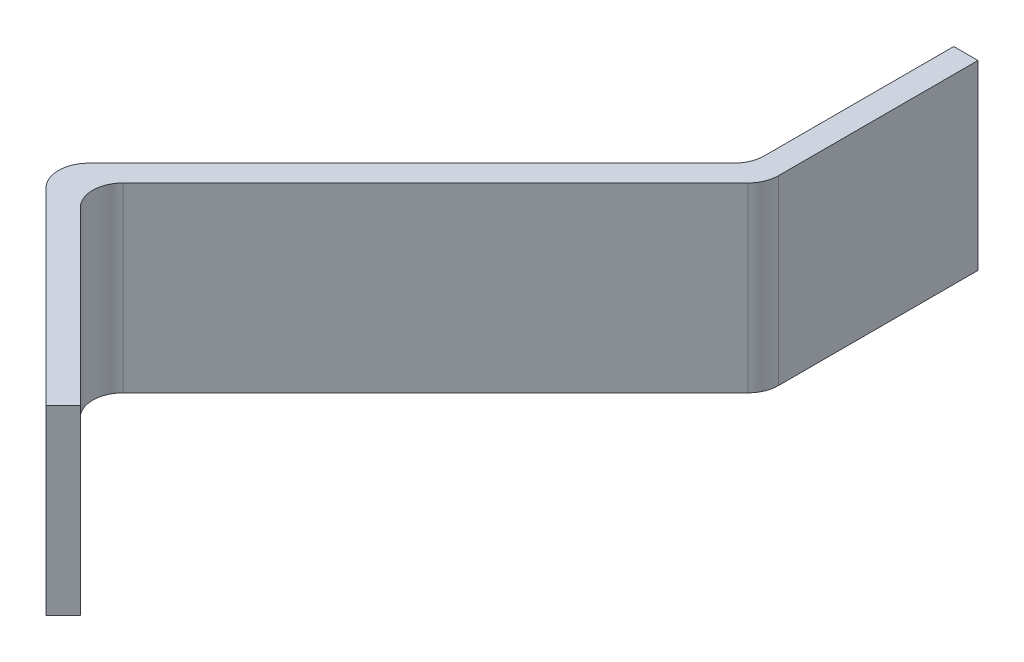
ISO-10303-21;
HEADER;
FILE_DESCRIPTION(('STEP AP214'),'2;1');
FILE_NAME('part.step','',(''),(''),'','','');
FILE_SCHEMA(('AUTOMOTIVE_DESIGN { 1 0 10303 214 1 1 1 1 }'));
ENDSEC;
DATA;
#1=APPLICATION_CONTEXT('core data for automotive mechanical design processes');
#2=APPLICATION_PROTOCOL_DEFINITION('international standard','automotive_design',2000,#1);
#3=PRODUCT_CONTEXT('',#1,'mechanical');
#4=PRODUCT('Part','Part','',(#3));
#5=PRODUCT_RELATED_PRODUCT_CATEGORY('part','',(#4));
#6=PRODUCT_DEFINITION_FORMATION('','',#4);
#7=PRODUCT_DEFINITION_CONTEXT('part definition',#1,'design');
#8=PRODUCT_DEFINITION('design','',#6,#7);
#9=PRODUCT_DEFINITION_SHAPE('','',#8);
#10=(LENGTH_UNIT() NAMED_UNIT(*) SI_UNIT(.MILLI.,.METRE.));
#11=(NAMED_UNIT(*) PLANE_ANGLE_UNIT() SI_UNIT($,.RADIAN.));
#12=(NAMED_UNIT(*) SI_UNIT($,.STERADIAN.) SOLID_ANGLE_UNIT());
#13=UNCERTAINTY_MEASURE_WITH_UNIT(LENGTH_MEASURE(1.E-05),#10,'distance_accuracy_value','');
#14=(GEOMETRIC_REPRESENTATION_CONTEXT(3) GLOBAL_UNCERTAINTY_ASSIGNED_CONTEXT((#13)) GLOBAL_UNIT_ASSIGNED_CONTEXT((#10,
#11,#12)) REPRESENTATION_CONTEXT('',''));
#15=CARTESIAN_POINT('',(0.,0.,0.));
#16=DIRECTION('',(0.,0.,1.));
#17=DIRECTION('',(1.,0.,0.));
#18=AXIS2_PLACEMENT_3D('',#15,#16,#17);
#19=CARTESIAN_POINT('',(-245.256587827417,-22.5,-1.7746032555829));
#20=DIRECTION('',(0.,1.,0.));
#21=DIRECTION('',(0.,0.,1.));
#22=AXIS2_PLACEMENT_3D('',#19,#20,#21);
#23=CYLINDRICAL_SURFACE('',#22,5.);
#24=CARTESIAN_POINT('',(-245.256587827417,7.5,-1.7746032555829));
#25=DIRECTION('',(0.,1.,0.));
#26=DIRECTION('',(0.,0.,1.));
#27=AXIS2_PLACEMENT_3D('',#24,#25,#26);
#28=CIRCLE('',#27,5.);
#29=CARTESIAN_POINT('',(-248.79212173335,7.5,-5.31013716151563));
#30=VERTEX_POINT('',#29);
#31=CARTESIAN_POINT('',(-248.79212173335,7.5,1.76093065034988));
#32=VERTEX_POINT('',#31);
#33=EDGE_CURVE('E154',#30,#32,#28,.T.);
#34=ORIENTED_EDGE('',*,*,#33,.F.);
#35=DIRECTION('',(0.,1.,0.));
#36=VECTOR('',#35,1.);
#37=CARTESIAN_POINT('',(-248.79212173335,-22.5,-5.31013716151563));
#38=LINE('',#37,#36);
#39=CARTESIAN_POINT('',(-248.79212173335,-22.5,-5.31013716151563));
#40=VERTEX_POINT('',#39);
#41=EDGE_CURVE('E11',#40,#30,#38,.T.);
#42=ORIENTED_EDGE('',*,*,#41,.F.);
#43=CARTESIAN_POINT('',(-245.256587827417,-22.5,-1.7746032555829));
#44=DIRECTION('',(0.,1.,0.));
#45=DIRECTION('',(0.,0.,1.));
#46=AXIS2_PLACEMENT_3D('',#43,#44,#45);
#47=CIRCLE('',#46,5.);
#48=CARTESIAN_POINT('',(-248.79212173335,-22.5,1.76093065034988));
#49=VERTEX_POINT('',#48);
#50=EDGE_CURVE('E186',#40,#49,#47,.T.);
#51=ORIENTED_EDGE('',*,*,#50,.T.);
#52=DIRECTION('',(0.,1.,0.));
#53=VECTOR('',#52,1.);
#54=CARTESIAN_POINT('',(-248.79212173335,-22.5,1.76093065034988));
#55=LINE('',#54,#53);
#56=EDGE_CURVE('E36',#49,#32,#55,.T.);
#57=ORIENTED_EDGE('',*,*,#56,.T.);
#58=EDGE_LOOP('',(#34,#42,#51,#57));
#59=FACE_BOUND('',#58,.T.);
#60=ADVANCED_FACE('F33',(#59),#23,.T.);
#61=CARTESIAN_POINT('',(-195.566724988935,-22.5,-58.5355339059331));
#62=DIRECTION('',(-0.707106781186565,0.,-0.70710678118653));
#63=DIRECTION('',(-0.70710678118653,0.,0.707106781186565));
#64=AXIS2_PLACEMENT_3D('',#61,#62,#63);
#65=PLANE('',#64);
#66=DIRECTION('',(-0.70710678118653,0.,0.707106781186565));
#67=VECTOR('',#66,1.);
#68=CARTESIAN_POINT('',(-195.566724988935,7.5,-58.5355339059331));
#69=LINE('',#68,#67);
#70=CARTESIAN_POINT('',(-195.566724988935,7.5,-58.5355339059331));
#71=VERTEX_POINT('',#70);
#72=EDGE_CURVE('E184',#71,#30,#69,.T.);
#73=ORIENTED_EDGE('',*,*,#72,.F.);
#74=DIRECTION('',(0.,1.,0.));
#75=VECTOR('',#74,1.);
#76=CARTESIAN_POINT('',(-195.566724988935,-22.5,-58.5355339059331));
#77=LINE('',#76,#75);
#78=CARTESIAN_POINT('',(-195.566724988935,-22.5,-58.5355339059331));
#79=VERTEX_POINT('',#78);
#80=EDGE_CURVE('E42',#79,#71,#77,.T.);
#81=ORIENTED_EDGE('',*,*,#80,.F.);
#82=DIRECTION('',(-0.70710678118653,0.,0.707106781186565));
#83=VECTOR('',#82,1.);
#84=CARTESIAN_POINT('',(-195.566724988935,-22.5,-58.5355339059331));
#85=LINE('',#84,#83);
#86=EDGE_CURVE('E144',#79,#40,#85,.T.);
#87=ORIENTED_EDGE('',*,*,#86,.T.);
#88=ORIENTED_EDGE('',*,*,#41,.T.);
#89=EDGE_LOOP('',(#73,#81,#87,#88));
#90=FACE_BOUND('',#89,.T.);
#91=ADVANCED_FACE('F206',(#90),#65,.T.);
#92=CARTESIAN_POINT('',(-199.102258894868,-22.5,-62.0710678118658));
#93=DIRECTION('',(0.,1.,0.));
#94=DIRECTION('',(0.,0.,1.));
#95=AXIS2_PLACEMENT_3D('',#92,#93,#94);
#96=CYLINDRICAL_SURFACE('',#95,4.99999999999999);
#97=CARTESIAN_POINT('',(-199.102258894868,7.5,-62.0710678118658));
#98=DIRECTION('',(0.,-1.,0.));
#99=DIRECTION('',(0.,0.,1.));
#100=AXIS2_PLACEMENT_3D('',#97,#98,#99);
#101=CIRCLE('',#100,4.99999999999999);
#102=CARTESIAN_POINT('',(-194.102258894868,7.5,-62.0710678118658));
#103=VERTEX_POINT('',#102);
#104=EDGE_CURVE('E131',#103,#71,#101,.T.);
#105=ORIENTED_EDGE('',*,*,#104,.F.);
#106=DIRECTION('',(0.,1.,0.));
#107=VECTOR('',#106,1.);
#108=CARTESIAN_POINT('',(-194.102258894868,-22.5,-62.0710678118658));
#109=LINE('',#108,#107);
#110=CARTESIAN_POINT('',(-194.102258894868,-22.5,-62.0710678118658));
#111=VERTEX_POINT('',#110);
#112=EDGE_CURVE('E126',#111,#103,#109,.T.);
#113=ORIENTED_EDGE('',*,*,#112,.F.);
#114=CARTESIAN_POINT('',(-199.102258894868,-22.5,-62.0710678118658));
#115=DIRECTION('',(0.,-1.,0.));
#116=DIRECTION('',(0.,0.,1.));
#117=AXIS2_PLACEMENT_3D('',#114,#115,#116);
#118=CIRCLE('',#117,4.99999999999999);
#119=EDGE_CURVE('E129',#111,#79,#118,.T.);
#120=ORIENTED_EDGE('',*,*,#119,.T.);
#121=ORIENTED_EDGE('',*,*,#80,.T.);
#122=EDGE_LOOP('',(#105,#113,#120,#121));
#123=FACE_BOUND('',#122,.T.);
#124=ADVANCED_FACE('F128',(#123),#96,.F.);
#125=CARTESIAN_POINT('',(-194.102258894868,-22.5,-93.343145750508));
#126=DIRECTION('',(-1.,0.,0.));
#127=DIRECTION('',(0.,0.,1.));
#128=AXIS2_PLACEMENT_3D('',#125,#126,#127);
#129=PLANE('',#128);
#130=DIRECTION('',(0.,0.,1.));
#131=VECTOR('',#130,1.);
#132=CARTESIAN_POINT('',(-194.102258894868,7.5,-93.343145750508));
#133=LINE('',#132,#131);
#134=CARTESIAN_POINT('',(-194.102258894868,7.5,-93.343145750508));
#135=VERTEX_POINT('',#134);
#136=EDGE_CURVE('E181',#135,#103,#133,.T.);
#137=ORIENTED_EDGE('',*,*,#136,.F.);
#138=DIRECTION('',(0.,1.,0.));
#139=VECTOR('',#138,1.);
#140=CARTESIAN_POINT('',(-194.102258894868,-22.5,-93.343145750508));
#141=LINE('',#140,#139);
#142=CARTESIAN_POINT('',(-194.102258894868,-22.5,-93.343145750508));
#143=VERTEX_POINT('',#142);
#144=EDGE_CURVE('E136',#143,#135,#141,.T.);
#145=ORIENTED_EDGE('',*,*,#144,.F.);
#146=DIRECTION('',(0.,0.,1.));
#147=VECTOR('',#146,1.);
#148=CARTESIAN_POINT('',(-194.102258894868,-22.5,-93.343145750508));
#149=LINE('',#148,#147);
#150=EDGE_CURVE('E142',#143,#111,#149,.T.);
#151=ORIENTED_EDGE('',*,*,#150,.T.);
#152=ORIENTED_EDGE('',*,*,#112,.T.);
#153=EDGE_LOOP('',(#137,#145,#151,#152));
#154=FACE_BOUND('',#153,.T.);
#155=ADVANCED_FACE('F146',(#154),#129,.T.);
#156=CARTESIAN_POINT('',(-190.102258894868,-22.5,-93.343145750508));
#157=DIRECTION('',(0.,0.,-1.));
#158=DIRECTION('',(-1.,0.,0.));
#159=AXIS2_PLACEMENT_3D('',#156,#157,#158);
#160=PLANE('',#159);
#161=DIRECTION('',(-1.,0.,0.));
#162=VECTOR('',#161,1.);
#163=CARTESIAN_POINT('',(-190.102258894868,7.5,-93.343145750508));
#164=LINE('',#163,#162);
#165=CARTESIAN_POINT('',(-190.102258894868,7.5,-93.343145750508));
#166=VERTEX_POINT('',#165);
#167=EDGE_CURVE('E178',#166,#135,#164,.T.);
#168=ORIENTED_EDGE('',*,*,#167,.F.);
#169=DIRECTION('',(0.,1.,0.));
#170=VECTOR('',#169,1.);
#171=CARTESIAN_POINT('',(-190.102258894868,-22.5,-93.343145750508));
#172=LINE('',#171,#170);
#173=CARTESIAN_POINT('',(-190.102258894868,-22.5,-93.343145750508));
#174=VERTEX_POINT('',#173);
#175=EDGE_CURVE('E190',#174,#166,#172,.T.);
#176=ORIENTED_EDGE('',*,*,#175,.F.);
#177=DIRECTION('',(-1.,0.,0.));
#178=VECTOR('',#177,1.);
#179=CARTESIAN_POINT('',(-190.102258894868,-22.5,-93.343145750508));
#180=LINE('',#179,#178);
#181=EDGE_CURVE('E147',#174,#143,#180,.T.);
#182=ORIENTED_EDGE('',*,*,#181,.T.);
#183=ORIENTED_EDGE('',*,*,#144,.T.);
#184=EDGE_LOOP('',(#168,#176,#182,#183));
#185=FACE_BOUND('',#184,.T.);
#186=ADVANCED_FACE('F219',(#185),#160,.T.);
#187=CARTESIAN_POINT('',(-190.102258894868,-22.5,-60.4142135623735));
#188=DIRECTION('',(1.,0.,0.));
#189=DIRECTION('',(0.,0.,-1.));
#190=AXIS2_PLACEMENT_3D('',#187,#188,#189);
#191=PLANE('',#190);
#192=DIRECTION('',(0.,0.,-1.));
#193=VECTOR('',#192,1.);
#194=CARTESIAN_POINT('',(-190.102258894868,7.5,-60.4142135623735));
#195=LINE('',#194,#193);
#196=CARTESIAN_POINT('',(-190.102258894868,7.5,-60.4142135623735));
#197=VERTEX_POINT('',#196);
#198=EDGE_CURVE('E175',#197,#166,#195,.T.);
#199=ORIENTED_EDGE('',*,*,#198,.F.);
#200=DIRECTION('',(0.,1.,0.));
#201=VECTOR('',#200,1.);
#202=CARTESIAN_POINT('',(-190.102258894868,-22.5,-60.4142135623735));
#203=LINE('',#202,#201);
#204=CARTESIAN_POINT('',(-190.102258894868,-22.5,-60.4142135623735));
#205=VERTEX_POINT('',#204);
#206=EDGE_CURVE('E192',#205,#197,#203,.T.);
#207=ORIENTED_EDGE('',*,*,#206,.F.);
#208=DIRECTION('',(0.,0.,-1.));
#209=VECTOR('',#208,1.);
#210=CARTESIAN_POINT('',(-190.102258894868,-22.5,-60.4142135623735));
#211=LINE('',#210,#209);
#212=EDGE_CURVE('E149',#205,#174,#211,.T.);
#213=ORIENTED_EDGE('',*,*,#212,.T.);
#214=ORIENTED_EDGE('',*,*,#175,.T.);
#215=EDGE_LOOP('',(#199,#207,#213,#214));
#216=FACE_BOUND('',#215,.T.);
#217=ADVANCED_FACE('F222',(#216),#191,.T.);
#218=CARTESIAN_POINT('',(-195.102258894868,-22.5,-60.4142135623735));
#219=DIRECTION('',(0.,1.,0.));
#220=DIRECTION('',(0.,0.,1.));
#221=AXIS2_PLACEMENT_3D('',#218,#219,#220);
#222=CYLINDRICAL_SURFACE('',#221,5.00000000000002);
#223=CARTESIAN_POINT('',(-195.102258894868,7.5,-60.4142135623735));
#224=DIRECTION('',(0.,1.,0.));
#225=DIRECTION('',(0.,0.,1.));
#226=AXIS2_PLACEMENT_3D('',#223,#224,#225);
#227=CIRCLE('',#226,5.00000000000002);
#228=CARTESIAN_POINT('',(-191.566724988935,7.5,-56.8786796564407));
#229=VERTEX_POINT('',#228);
#230=EDGE_CURVE('E172',#229,#197,#227,.T.);
#231=ORIENTED_EDGE('',*,*,#230,.F.);
#232=DIRECTION('',(0.,1.,0.));
#233=VECTOR('',#232,1.);
#234=CARTESIAN_POINT('',(-191.566724988935,-22.5,-56.8786796564407));
#235=LINE('',#234,#233);
#236=CARTESIAN_POINT('',(-191.566724988935,-22.5,-56.8786796564407));
#237=VERTEX_POINT('',#236);
#238=EDGE_CURVE('E194',#237,#229,#235,.T.);
#239=ORIENTED_EDGE('',*,*,#238,.F.);
#240=CARTESIAN_POINT('',(-195.102258894868,-22.5,-60.4142135623735));
#241=DIRECTION('',(0.,1.,0.));
#242=DIRECTION('',(0.,0.,1.));
#243=AXIS2_PLACEMENT_3D('',#240,#241,#242);
#244=CIRCLE('',#243,5.00000000000002);
#245=EDGE_CURVE('E348',#237,#205,#244,.T.);
#246=ORIENTED_EDGE('',*,*,#245,.T.);
#247=ORIENTED_EDGE('',*,*,#206,.T.);
#248=EDGE_LOOP('',(#231,#239,#246,#247));
#249=FACE_BOUND('',#248,.T.);
#250=ADVANCED_FACE('F226',(#249),#222,.T.);
#251=CARTESIAN_POINT('',(-243.135267483858,-22.5,-5.31013716151564));
#252=DIRECTION('',(0.707106781186564,0.,0.70710678118653));
#253=DIRECTION('',(0.707106781186531,0.,-0.707106781186565));
#254=AXIS2_PLACEMENT_3D('',#251,#252,#253);
#255=PLANE('',#254);
#256=DIRECTION('',(0.707106781186531,0.,-0.707106781186565));
#257=VECTOR('',#256,1.);
#258=CARTESIAN_POINT('',(-243.135267483858,7.5,-5.31013716151564));
#259=LINE('',#258,#257);
#260=CARTESIAN_POINT('',(-243.135267483858,7.5,-5.31013716151564));
#261=VERTEX_POINT('',#260);
#262=EDGE_CURVE('E169',#261,#229,#259,.T.);
#263=ORIENTED_EDGE('',*,*,#262,.F.);
#264=DIRECTION('',(0.,1.,0.));
#265=VECTOR('',#264,1.);
#266=CARTESIAN_POINT('',(-243.135267483858,-22.5,-5.31013716151564));
#267=LINE('',#266,#265);
#268=CARTESIAN_POINT('',(-243.135267483858,-22.5,-5.31013716151564));
#269=VERTEX_POINT('',#268);
#270=EDGE_CURVE('E196',#269,#261,#267,.T.);
#271=ORIENTED_EDGE('',*,*,#270,.F.);
#272=DIRECTION('',(0.707106781186531,0.,-0.707106781186565));
#273=VECTOR('',#272,1.);
#274=CARTESIAN_POINT('',(-243.135267483858,-22.5,-5.31013716151564));
#275=LINE('',#274,#273);
#276=EDGE_CURVE('E352',#269,#237,#275,.T.);
#277=ORIENTED_EDGE('',*,*,#276,.T.);
#278=ORIENTED_EDGE('',*,*,#238,.T.);
#279=EDGE_LOOP('',(#263,#271,#277,#278));
#280=FACE_BOUND('',#279,.T.);
#281=ADVANCED_FACE('F230',(#280),#255,.T.);
#282=CARTESIAN_POINT('',(-239.599733577925,-22.5,-1.77460325558297));
#283=DIRECTION('',(0.,1.,0.));
#284=DIRECTION('',(0.,0.,1.));
#285=AXIS2_PLACEMENT_3D('',#282,#283,#284);
#286=CYLINDRICAL_SURFACE('',#285,5.00000000000001);
#287=CARTESIAN_POINT('',(-239.599733577925,7.5,-1.77460325558297));
#288=DIRECTION('',(0.,-1.,0.));
#289=DIRECTION('',(0.,0.,1.));
#290=AXIS2_PLACEMENT_3D('',#287,#288,#289);
#291=CIRCLE('',#290,5.00000000000001);
#292=CARTESIAN_POINT('',(-243.135267483858,7.5,1.76093065034976));
#293=VERTEX_POINT('',#292);
#294=EDGE_CURVE('E166',#293,#261,#291,.T.);
#295=ORIENTED_EDGE('',*,*,#294,.F.);
#296=DIRECTION('',(0.,1.,0.));
#297=VECTOR('',#296,1.);
#298=CARTESIAN_POINT('',(-243.135267483858,-22.5,1.76093065034976));
#299=LINE('',#298,#297);
#300=CARTESIAN_POINT('',(-243.135267483858,-22.5,1.76093065034976));
#301=VERTEX_POINT('',#300);
#302=EDGE_CURVE('E198',#301,#293,#299,.T.);
#303=ORIENTED_EDGE('',*,*,#302,.F.);
#304=CARTESIAN_POINT('',(-239.599733577925,-22.5,-1.77460325558297));
#305=DIRECTION('',(0.,-1.,0.));
#306=DIRECTION('',(0.,0.,1.));
#307=AXIS2_PLACEMENT_3D('',#304,#305,#306);
#308=CIRCLE('',#307,5.00000000000001);
#309=EDGE_CURVE('E341',#301,#269,#308,.T.);
#310=ORIENTED_EDGE('',*,*,#309,.T.);
#311=ORIENTED_EDGE('',*,*,#270,.T.);
#312=EDGE_LOOP('',(#295,#303,#310,#311));
#313=FACE_BOUND('',#312,.T.);
#314=ADVANCED_FACE('F234',(#313),#286,.F.);
#315=CARTESIAN_POINT('',(-214.850996236395,-22.5,30.0452018978113));
#316=DIRECTION('',(0.707106781186535,0.,-0.707106781186561));
#317=DIRECTION('',(-0.707106781186561,0.,-0.707106781186535));
#318=AXIS2_PLACEMENT_3D('',#315,#316,#317);
#319=PLANE('',#318);
#320=DIRECTION('',(-0.707106781186561,0.,-0.707106781186534));
#321=VECTOR('',#320,1.);
#322=CARTESIAN_POINT('',(-214.850996236395,7.5,30.0452018978113));
#323=LINE('',#322,#321);
#324=CARTESIAN_POINT('',(-214.850996236395,7.5,30.0452018978113));
#325=VERTEX_POINT('',#324);
#326=EDGE_CURVE('E163',#325,#293,#323,.T.);
#327=ORIENTED_EDGE('',*,*,#326,.F.);
#328=DIRECTION('',(0.,1.,0.));
#329=VECTOR('',#328,1.);
#330=CARTESIAN_POINT('',(-214.850996236395,-22.5,30.0452018978113));
#331=LINE('',#330,#329);
#332=CARTESIAN_POINT('',(-214.850996236395,-22.5,30.0452018978113));
#333=VERTEX_POINT('',#332);
#334=EDGE_CURVE('E200',#333,#325,#331,.T.);
#335=ORIENTED_EDGE('',*,*,#334,.F.);
#336=DIRECTION('',(-0.707106781186561,0.,-0.707106781186534));
#337=VECTOR('',#336,1.);
#338=CARTESIAN_POINT('',(-214.850996236395,-22.5,30.0452018978113));
#339=LINE('',#338,#337);
#340=EDGE_CURVE('E337',#333,#301,#339,.T.);
#341=ORIENTED_EDGE('',*,*,#340,.T.);
#342=ORIENTED_EDGE('',*,*,#302,.T.);
#343=EDGE_LOOP('',(#327,#335,#341,#342));
#344=FACE_BOUND('',#343,.T.);
#345=ADVANCED_FACE('F238',(#344),#319,.T.);
#346=CARTESIAN_POINT('',(-217.679423361141,-22.5,32.8736290225575));
#347=DIRECTION('',(0.707106781186561,0.,0.707106781186534));
#348=DIRECTION('',(0.707106781186534,0.,-0.707106781186561));
#349=AXIS2_PLACEMENT_3D('',#346,#347,#348);
#350=PLANE('',#349);
#351=DIRECTION('',(0.707106781186534,0.,-0.707106781186561));
#352=VECTOR('',#351,1.);
#353=CARTESIAN_POINT('',(-217.679423361141,7.5,32.8736290225575));
#354=LINE('',#353,#352);
#355=CARTESIAN_POINT('',(-217.679423361141,7.5,32.8736290225575));
#356=VERTEX_POINT('',#355);
#357=EDGE_CURVE('E160',#356,#325,#354,.T.);
#358=ORIENTED_EDGE('',*,*,#357,.F.);
#359=DIRECTION('',(0.,1.,0.));
#360=VECTOR('',#359,1.);
#361=CARTESIAN_POINT('',(-217.679423361141,-22.5,32.8736290225575));
#362=LINE('',#361,#360);
#363=CARTESIAN_POINT('',(-217.679423361141,-22.5,32.8736290225575));
#364=VERTEX_POINT('',#363);
#365=EDGE_CURVE('E201',#364,#356,#362,.T.);
#366=ORIENTED_EDGE('',*,*,#365,.F.);
#367=DIRECTION('',(0.707106781186534,0.,-0.707106781186561));
#368=VECTOR('',#367,1.);
#369=CARTESIAN_POINT('',(-217.679423361141,-22.5,32.8736290225575));
#370=LINE('',#369,#368);
#371=EDGE_CURVE('E358',#364,#333,#370,.T.);
#372=ORIENTED_EDGE('',*,*,#371,.T.);
#373=ORIENTED_EDGE('',*,*,#334,.T.);
#374=EDGE_LOOP('',(#358,#366,#372,#373));
#375=FACE_BOUND('',#374,.T.);
#376=ADVANCED_FACE('F242',(#375),#350,.T.);
#377=CARTESIAN_POINT('',(-248.79212173335,-22.5,1.76093065034988));
#378=DIRECTION('',(-0.707106781186534,0.,0.707106781186561));
#379=DIRECTION('',(0.707106781186561,0.,0.707106781186534));
#380=AXIS2_PLACEMENT_3D('',#377,#378,#379);
#381=PLANE('',#380);
#382=DIRECTION('',(0.707106781186561,0.,0.707106781186534));
#383=VECTOR('',#382,1.);
#384=CARTESIAN_POINT('',(-248.79212173335,7.5,1.76093065034988));
#385=LINE('',#384,#383);
#386=EDGE_CURVE('E157',#32,#356,#385,.T.);
#387=ORIENTED_EDGE('',*,*,#386,.F.);
#388=ORIENTED_EDGE('',*,*,#56,.F.);
#389=DIRECTION('',(0.707106781186561,0.,0.707106781186534));
#390=VECTOR('',#389,1.);
#391=CARTESIAN_POINT('',(-248.79212173335,-22.5,1.76093065034988));
#392=LINE('',#391,#390);
#393=EDGE_CURVE('E360',#49,#364,#392,.T.);
#394=ORIENTED_EDGE('',*,*,#393,.T.);
#395=ORIENTED_EDGE('',*,*,#365,.T.);
#396=EDGE_LOOP('',(#387,#388,#394,#395));
#397=FACE_BOUND('',#396,.T.);
#398=ADVANCED_FACE('F203',(#397),#381,.T.);
#399=CARTESIAN_POINT('',(-245.256587827417,-22.5,-1.7746032555829));
#400=DIRECTION('',(0.,1.,0.));
#401=DIRECTION('',(0.,0.,1.));
#402=AXIS2_PLACEMENT_3D('',#399,#400,#401);
#403=PLANE('',#402);
#404=ORIENTED_EDGE('',*,*,#50,.F.);
#405=ORIENTED_EDGE('',*,*,#86,.F.);
#406=ORIENTED_EDGE('',*,*,#119,.F.);
#407=ORIENTED_EDGE('',*,*,#150,.F.);
#408=ORIENTED_EDGE('',*,*,#181,.F.);
#409=ORIENTED_EDGE('',*,*,#212,.F.);
#410=ORIENTED_EDGE('',*,*,#245,.F.);
#411=ORIENTED_EDGE('',*,*,#276,.F.);
#412=ORIENTED_EDGE('',*,*,#309,.F.);
#413=ORIENTED_EDGE('',*,*,#340,.F.);
#414=ORIENTED_EDGE('',*,*,#371,.F.);
#415=ORIENTED_EDGE('',*,*,#393,.F.);
#416=EDGE_LOOP('',(#404,#405,#406,#407,#408,#409,#410,#411,#412,#413,#414,#415));
#417=FACE_BOUND('',#416,.T.);
#418=ADVANCED_FACE('F140',(#417),#403,.F.);
#419=CARTESIAN_POINT('',(-245.256587827417,7.5,-1.7746032555829));
#420=DIRECTION('',(0.,1.,0.));
#421=DIRECTION('',(0.,0.,1.));
#422=AXIS2_PLACEMENT_3D('',#419,#420,#421);
#423=PLANE('',#422);
#424=ORIENTED_EDGE('',*,*,#33,.T.);
#425=ORIENTED_EDGE('',*,*,#386,.T.);
#426=ORIENTED_EDGE('',*,*,#357,.T.);
#427=ORIENTED_EDGE('',*,*,#326,.T.);
#428=ORIENTED_EDGE('',*,*,#294,.T.);
#429=ORIENTED_EDGE('',*,*,#262,.T.);
#430=ORIENTED_EDGE('',*,*,#230,.T.);
#431=ORIENTED_EDGE('',*,*,#198,.T.);
#432=ORIENTED_EDGE('',*,*,#167,.T.);
#433=ORIENTED_EDGE('',*,*,#136,.T.);
#434=ORIENTED_EDGE('',*,*,#104,.T.);
#435=ORIENTED_EDGE('',*,*,#72,.T.);
#436=EDGE_LOOP('',(#424,#425,#426,#427,#428,#429,#430,#431,#432,#433,#434,#435));
#437=FACE_BOUND('',#436,.T.);
#438=ADVANCED_FACE('F205',(#437),#423,.T.);
#439=CLOSED_SHELL('',(#60,#91,#124,#155,#186,#217,#250,#281,#314,#345,#376,#398,#418,#438));
#440=MANIFOLD_SOLID_BREP('B2',#439);
#441=ADVANCED_BREP_SHAPE_REPRESENTATION('',(#18,#440),#14);
#442=SHAPE_DEFINITION_REPRESENTATION(#9,#441);
ENDSEC;
END-ISO-10303-21;
